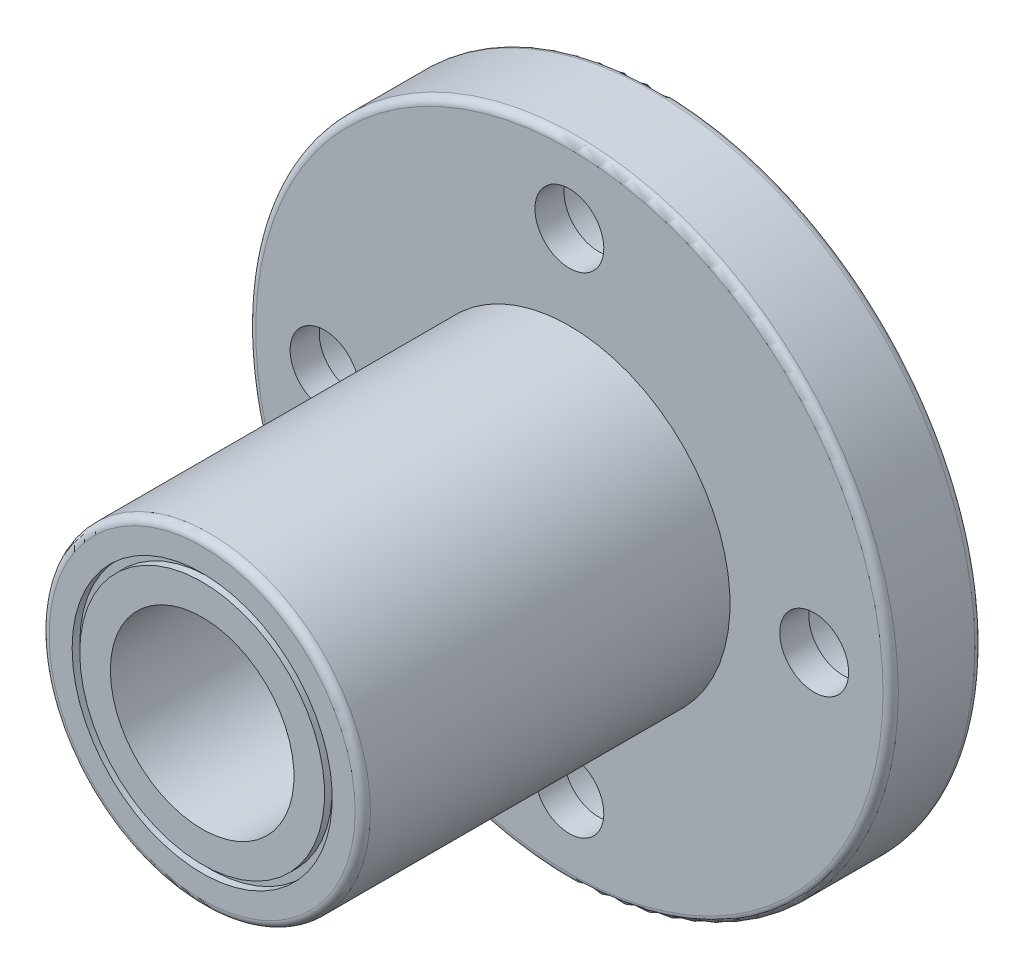
ISO-10303-21;
HEADER;
FILE_DESCRIPTION(('STEP AP214'),'2;1');
FILE_NAME('part.step','',(''),(''),'','','');
FILE_SCHEMA(('AUTOMOTIVE_DESIGN { 1 0 10303 214 1 1 1 1 }'));
ENDSEC;
DATA;
#1=APPLICATION_CONTEXT('core data for automotive mechanical design processes');
#2=APPLICATION_PROTOCOL_DEFINITION('international standard','automotive_design',2000,#1);
#3=PRODUCT_CONTEXT('',#1,'mechanical');
#4=PRODUCT('Part','Part','',(#3));
#5=PRODUCT_RELATED_PRODUCT_CATEGORY('part','',(#4));
#6=PRODUCT_DEFINITION_FORMATION('','',#4);
#7=PRODUCT_DEFINITION_CONTEXT('part definition',#1,'design');
#8=PRODUCT_DEFINITION('design','',#6,#7);
#9=PRODUCT_DEFINITION_SHAPE('','',#8);
#10=(LENGTH_UNIT() NAMED_UNIT(*) SI_UNIT(.MILLI.,.METRE.));
#11=(NAMED_UNIT(*) PLANE_ANGLE_UNIT() SI_UNIT($,.RADIAN.));
#12=(NAMED_UNIT(*) SI_UNIT($,.STERADIAN.) SOLID_ANGLE_UNIT());
#13=UNCERTAINTY_MEASURE_WITH_UNIT(LENGTH_MEASURE(1.E-05),#10,'distance_accuracy_value','');
#14=(GEOMETRIC_REPRESENTATION_CONTEXT(3) GLOBAL_UNCERTAINTY_ASSIGNED_CONTEXT((#13)) GLOBAL_UNIT_ASSIGNED_CONTEXT((#10,
#11,#12)) REPRESENTATION_CONTEXT('',''));
#15=CARTESIAN_POINT('',(0.,0.,0.));
#16=DIRECTION('',(0.,0.,1.));
#17=DIRECTION('',(1.,0.,0.));
#18=AXIS2_PLACEMENT_3D('',#15,#16,#17);
#19=CARTESIAN_POINT('',(0.,10.5,0.));
#20=DIRECTION('',(0.,0.,-1.));
#21=DIRECTION('',(-1.,0.,0.));
#22=AXIS2_PLACEMENT_3D('',#19,#20,#21);
#23=PLANE('',#22);
#24=CARTESIAN_POINT('',(0.,0.,0.));
#25=DIRECTION('',(0.,0.,-1.));
#26=DIRECTION('',(-1.,0.,0.));
#27=AXIS2_PLACEMENT_3D('',#24,#25,#26);
#28=CIRCLE('',#27,20.5);
#29=CARTESIAN_POINT('',(-20.5,0.,0.));
#30=VERTEX_POINT('',#29);
#31=EDGE_CURVE('E70',#30,#30,#28,.T.);
#32=ORIENTED_EDGE('',*,*,#31,.T.);
#33=EDGE_LOOP('',(#32));
#34=FACE_BOUND('',#33,.T.);
#35=CARTESIAN_POINT('',(0.,-16.,0.));
#36=DIRECTION('',(0.,0.,1.));
#37=DIRECTION('',(0.,1.,0.));
#38=AXIS2_PLACEMENT_3D('',#35,#36,#37);
#39=CIRCLE('',#38,3.75);
#40=CARTESIAN_POINT('',(0.,-12.25,0.));
#41=VERTEX_POINT('',#40);
#42=EDGE_CURVE('E164',#41,#41,#39,.T.);
#43=ORIENTED_EDGE('',*,*,#42,.T.);
#44=EDGE_LOOP('',(#43));
#45=FACE_BOUND('',#44,.T.);
#46=CARTESIAN_POINT('',(0.,16.,0.));
#47=DIRECTION('',(0.,0.,1.));
#48=DIRECTION('',(0.,-1.,0.));
#49=AXIS2_PLACEMENT_3D('',#46,#47,#48);
#50=CIRCLE('',#49,3.75);
#51=CARTESIAN_POINT('',(0.,12.25,0.));
#52=VERTEX_POINT('',#51);
#53=EDGE_CURVE('E132',#52,#52,#50,.T.);
#54=ORIENTED_EDGE('',*,*,#53,.T.);
#55=EDGE_LOOP('',(#54));
#56=FACE_BOUND('',#55,.T.);
#57=CARTESIAN_POINT('',(0.,0.,0.));
#58=DIRECTION('',(0.,0.,-1.));
#59=DIRECTION('',(-1.,0.,0.));
#60=AXIS2_PLACEMENT_3D('',#57,#58,#59);
#61=CIRCLE('',#60,10.5);
#62=CARTESIAN_POINT('',(-10.5,0.,0.));
#63=VERTEX_POINT('',#62);
#64=EDGE_CURVE('E128',#63,#63,#61,.T.);
#65=ORIENTED_EDGE('',*,*,#64,.F.);
#66=EDGE_LOOP('',(#65));
#67=FACE_BOUND('',#66,.T.);
#68=CARTESIAN_POINT('',(16.,0.,0.));
#69=DIRECTION('',(0.,0.,1.));
#70=DIRECTION('',(-1.,0.,0.));
#71=AXIS2_PLACEMENT_3D('',#68,#69,#70);
#72=CIRCLE('',#71,3.75);
#73=CARTESIAN_POINT('',(12.25,0.,0.));
#74=VERTEX_POINT('',#73);
#75=EDGE_CURVE('E148',#74,#74,#72,.T.);
#76=ORIENTED_EDGE('',*,*,#75,.T.);
#77=EDGE_LOOP('',(#76));
#78=FACE_BOUND('',#77,.T.);
#79=CARTESIAN_POINT('',(-16.,1.6759110426447E-13,0.));
#80=DIRECTION('',(0.,0.,1.));
#81=DIRECTION('',(1.,0.,0.));
#82=AXIS2_PLACEMENT_3D('',#79,#80,#81);
#83=CIRCLE('',#82,3.75);
#84=CARTESIAN_POINT('',(-12.25,1.28311939202485E-13,0.));
#85=VERTEX_POINT('',#84);
#86=EDGE_CURVE('E180',#85,#85,#83,.T.);
#87=ORIENTED_EDGE('',*,*,#86,.T.);
#88=EDGE_LOOP('',(#87));
#89=FACE_BOUND('',#88,.T.);
#90=ADVANCED_FACE('F40',(#34,#45,#56,#67,#78,#89),#23,.T.);
#91=CARTESIAN_POINT('',(0.,21.,6.));
#92=DIRECTION('',(0.,0.,1.));
#93=DIRECTION('',(1.,0.,0.));
#94=AXIS2_PLACEMENT_3D('',#91,#92,#93);
#95=PLANE('',#94);
#96=CARTESIAN_POINT('',(0.,0.,6.));
#97=DIRECTION('',(0.,0.,1.));
#98=DIRECTION('',(1.,0.,0.));
#99=AXIS2_PLACEMENT_3D('',#96,#97,#98);
#100=CIRCLE('',#99,20.5);
#101=CARTESIAN_POINT('',(20.5,0.,6.));
#102=VERTEX_POINT('',#101);
#103=EDGE_CURVE('E55',#102,#102,#100,.T.);
#104=ORIENTED_EDGE('',*,*,#103,.T.);
#105=EDGE_LOOP('',(#104));
#106=FACE_BOUND('',#105,.T.);
#107=CARTESIAN_POINT('',(0.,-16.,6.));
#108=DIRECTION('',(0.,0.,1.));
#109=DIRECTION('',(0.,1.,0.));
#110=AXIS2_PLACEMENT_3D('',#107,#108,#109);
#111=CIRCLE('',#110,2.24999999999999);
#112=CARTESIAN_POINT('',(0.,-13.75,6.00000000000001));
#113=VERTEX_POINT('',#112);
#114=EDGE_CURVE('E176',#113,#113,#111,.T.);
#115=ORIENTED_EDGE('',*,*,#114,.F.);
#116=EDGE_LOOP('',(#115));
#117=FACE_BOUND('',#116,.T.);
#118=CARTESIAN_POINT('',(0.,16.,6.));
#119=DIRECTION('',(0.,0.,1.));
#120=DIRECTION('',(0.,-1.,0.));
#121=AXIS2_PLACEMENT_3D('',#118,#119,#120);
#122=CIRCLE('',#121,2.24999999999999);
#123=CARTESIAN_POINT('',(0.,13.75,6.00000000000001));
#124=VERTEX_POINT('',#123);
#125=EDGE_CURVE('E144',#124,#124,#122,.T.);
#126=ORIENTED_EDGE('',*,*,#125,.F.);
#127=EDGE_LOOP('',(#126));
#128=FACE_BOUND('',#127,.T.);
#129=CARTESIAN_POINT('',(0.,0.,6.));
#130=DIRECTION('',(0.,0.,-1.));
#131=DIRECTION('',(-1.,0.,0.));
#132=AXIS2_PLACEMENT_3D('',#129,#130,#131);
#133=CIRCLE('',#132,10.5);
#134=CARTESIAN_POINT('',(-10.5,0.,6.));
#135=VERTEX_POINT('',#134);
#136=EDGE_CURVE('E73',#135,#135,#133,.T.);
#137=ORIENTED_EDGE('',*,*,#136,.T.);
#138=EDGE_LOOP('',(#137));
#139=FACE_BOUND('',#138,.T.);
#140=CARTESIAN_POINT('',(16.,0.,6.));
#141=DIRECTION('',(0.,0.,1.));
#142=DIRECTION('',(-1.,0.,0.));
#143=AXIS2_PLACEMENT_3D('',#140,#141,#142);
#144=CIRCLE('',#143,2.24999999999999);
#145=CARTESIAN_POINT('',(13.75,0.,6.00000000000001));
#146=VERTEX_POINT('',#145);
#147=EDGE_CURVE('E160',#146,#146,#144,.T.);
#148=ORIENTED_EDGE('',*,*,#147,.F.);
#149=EDGE_LOOP('',(#148));
#150=FACE_BOUND('',#149,.T.);
#151=CARTESIAN_POINT('',(-16.,1.67591104264471E-13,6.));
#152=DIRECTION('',(0.,0.,1.));
#153=DIRECTION('',(1.,0.,0.));
#154=AXIS2_PLACEMENT_3D('',#151,#152,#153);
#155=CIRCLE('',#154,2.24999999999999);
#156=CARTESIAN_POINT('',(-13.75,1.4402360522728E-13,6.00000000000001));
#157=VERTEX_POINT('',#156);
#158=EDGE_CURVE('E192',#157,#157,#155,.T.);
#159=ORIENTED_EDGE('',*,*,#158,.F.);
#160=EDGE_LOOP('',(#159));
#161=FACE_BOUND('',#160,.T.);
#162=ADVANCED_FACE('F200',(#106,#117,#128,#139,#150,#161),#95,.T.);
#163=CARTESIAN_POINT('',(0.,0.,0.));
#164=DIRECTION('',(0.,0.,-1.));
#165=DIRECTION('',(-1.,0.,0.));
#166=AXIS2_PLACEMENT_3D('',#163,#164,#165);
#167=CYLINDRICAL_SURFACE('',#166,21.);
#168=CARTESIAN_POINT('',(0.,0.,0.5));
#169=DIRECTION('',(0.,0.,-1.));
#170=DIRECTION('',(-1.,0.,0.));
#171=AXIS2_PLACEMENT_3D('',#168,#169,#170);
#172=CIRCLE('',#171,21.);
#173=CARTESIAN_POINT('',(-21.,0.,0.5));
#174=VERTEX_POINT('',#173);
#175=EDGE_CURVE('E61',#174,#174,#172,.F.);
#176=ORIENTED_EDGE('',*,*,#175,.T.);
#177=EDGE_LOOP('',(#176));
#178=FACE_BOUND('',#177,.T.);
#179=CARTESIAN_POINT('',(0.,0.,5.5));
#180=DIRECTION('',(0.,0.,1.));
#181=DIRECTION('',(1.,0.,0.));
#182=AXIS2_PLACEMENT_3D('',#179,#180,#181);
#183=CIRCLE('',#182,21.);
#184=CARTESIAN_POINT('',(21.,0.,5.5));
#185=VERTEX_POINT('',#184);
#186=EDGE_CURVE('E66',#185,#185,#183,.F.);
#187=ORIENTED_EDGE('',*,*,#186,.T.);
#188=EDGE_LOOP('',(#187));
#189=FACE_BOUND('',#188,.T.);
#190=ADVANCED_FACE('F202',(#178,#189),#167,.T.);
#191=CARTESIAN_POINT('',(0.,0.,0.));
#192=DIRECTION('',(0.,0.,-1.));
#193=DIRECTION('',(-1.,0.,0.));
#194=AXIS2_PLACEMENT_3D('',#191,#192,#193);
#195=CYLINDRICAL_SURFACE('',#194,10.5);
#196=CARTESIAN_POINT('',(0.,0.,29.5));
#197=DIRECTION('',(0.,0.,1.));
#198=DIRECTION('',(1.,0.,0.));
#199=AXIS2_PLACEMENT_3D('',#196,#197,#198);
#200=CIRCLE('',#199,10.5);
#201=CARTESIAN_POINT('',(10.5,0.,29.5));
#202=VERTEX_POINT('',#201);
#203=EDGE_CURVE('E48',#202,#202,#200,.F.);
#204=ORIENTED_EDGE('',*,*,#203,.T.);
#205=EDGE_LOOP('',(#204));
#206=FACE_BOUND('',#205,.T.);
#207=ORIENTED_EDGE('',*,*,#136,.F.);
#208=EDGE_LOOP('',(#207));
#209=FACE_BOUND('',#208,.T.);
#210=ADVANCED_FACE('F209',(#206,#209),#195,.T.);
#211=CARTESIAN_POINT('',(0.,10.5,30.));
#212=DIRECTION('',(0.,0.,1.));
#213=DIRECTION('',(1.,0.,0.));
#214=AXIS2_PLACEMENT_3D('',#211,#212,#213);
#215=PLANE('',#214);
#216=CARTESIAN_POINT('',(0.,0.,30.));
#217=DIRECTION('',(0.,0.,1.));
#218=DIRECTION('',(1.,0.,0.));
#219=AXIS2_PLACEMENT_3D('',#216,#217,#218);
#220=CIRCLE('',#219,10.);
#221=CARTESIAN_POINT('',(10.,0.,30.));
#222=VERTEX_POINT('',#221);
#223=EDGE_CURVE('E10',#222,#222,#220,.T.);
#224=ORIENTED_EDGE('',*,*,#223,.T.);
#225=EDGE_LOOP('',(#224));
#226=FACE_BOUND('',#225,.T.);
#227=CARTESIAN_POINT('',(0.,0.,30.));
#228=DIRECTION('',(0.,0.,-1.));
#229=DIRECTION('',(-1.,0.,0.));
#230=AXIS2_PLACEMENT_3D('',#227,#228,#229);
#231=CIRCLE('',#230,8.5);
#232=CARTESIAN_POINT('',(-8.5,0.,30.));
#233=VERTEX_POINT('',#232);
#234=EDGE_CURVE('E77',#233,#233,#231,.T.);
#235=ORIENTED_EDGE('',*,*,#234,.T.);
#236=EDGE_LOOP('',(#235));
#237=FACE_BOUND('',#236,.T.);
#238=ADVANCED_FACE('F466',(#226,#237),#215,.T.);
#239=CARTESIAN_POINT('',(0.,0.,0.));
#240=DIRECTION('',(0.,0.,-1.));
#241=DIRECTION('',(-1.,0.,0.));
#242=AXIS2_PLACEMENT_3D('',#239,#240,#241);
#243=CYLINDRICAL_SURFACE('',#242,8.5);
#244=CARTESIAN_POINT('',(0.,0.,29.5));
#245=DIRECTION('',(0.,0.,-1.));
#246=DIRECTION('',(-1.,0.,0.));
#247=AXIS2_PLACEMENT_3D('',#244,#245,#246);
#248=CIRCLE('',#247,8.5);
#249=CARTESIAN_POINT('',(-8.5,0.,29.5));
#250=VERTEX_POINT('',#249);
#251=EDGE_CURVE('E81',#250,#250,#248,.T.);
#252=ORIENTED_EDGE('',*,*,#251,.T.);
#253=EDGE_LOOP('',(#252));
#254=FACE_BOUND('',#253,.T.);
#255=ORIENTED_EDGE('',*,*,#234,.F.);
#256=EDGE_LOOP('',(#255));
#257=FACE_BOUND('',#256,.T.);
#258=ADVANCED_FACE('F457',(#254,#257),#243,.F.);
#259=CARTESIAN_POINT('',(0.,8.5,29.5));
#260=DIRECTION('',(0.,0.,1.));
#261=DIRECTION('',(1.,0.,0.));
#262=AXIS2_PLACEMENT_3D('',#259,#260,#261);
#263=PLANE('',#262);
#264=CARTESIAN_POINT('',(0.,0.,29.5));
#265=DIRECTION('',(0.,0.,-1.));
#266=DIRECTION('',(-1.,0.,0.));
#267=AXIS2_PLACEMENT_3D('',#264,#265,#266);
#268=CIRCLE('',#267,8.);
#269=CARTESIAN_POINT('',(-8.,0.,29.5));
#270=VERTEX_POINT('',#269);
#271=EDGE_CURVE('E85',#270,#270,#268,.T.);
#272=ORIENTED_EDGE('',*,*,#271,.T.);
#273=EDGE_LOOP('',(#272));
#274=FACE_BOUND('',#273,.T.);
#275=ORIENTED_EDGE('',*,*,#251,.F.);
#276=EDGE_LOOP('',(#275));
#277=FACE_BOUND('',#276,.T.);
#278=ADVANCED_FACE('F448',(#274,#277),#263,.T.);
#279=CARTESIAN_POINT('',(0.,0.,0.));
#280=DIRECTION('',(0.,0.,-1.));
#281=DIRECTION('',(-1.,0.,0.));
#282=AXIS2_PLACEMENT_3D('',#279,#280,#281);
#283=CYLINDRICAL_SURFACE('',#282,8.);
#284=CARTESIAN_POINT('',(0.,0.,30.));
#285=DIRECTION('',(0.,0.,-1.));
#286=DIRECTION('',(-1.,0.,0.));
#287=AXIS2_PLACEMENT_3D('',#284,#285,#286);
#288=CIRCLE('',#287,8.);
#289=CARTESIAN_POINT('',(-8.,0.,30.));
#290=VERTEX_POINT('',#289);
#291=EDGE_CURVE('E89',#290,#290,#288,.T.);
#292=ORIENTED_EDGE('',*,*,#291,.T.);
#293=EDGE_LOOP('',(#292));
#294=FACE_BOUND('',#293,.T.);
#295=ORIENTED_EDGE('',*,*,#271,.F.);
#296=EDGE_LOOP('',(#295));
#297=FACE_BOUND('',#296,.T.);
#298=ADVANCED_FACE('F440',(#294,#297),#283,.T.);
#299=CARTESIAN_POINT('',(0.,8.,30.));
#300=DIRECTION('',(0.,0.,1.));
#301=DIRECTION('',(1.,0.,0.));
#302=AXIS2_PLACEMENT_3D('',#299,#300,#301);
#303=PLANE('',#302);
#304=CARTESIAN_POINT('',(0.,0.,30.));
#305=DIRECTION('',(0.,0.,-1.));
#306=DIRECTION('',(-1.,0.,0.));
#307=AXIS2_PLACEMENT_3D('',#304,#305,#306);
#308=CIRCLE('',#307,6.);
#309=CARTESIAN_POINT('',(-6.,0.,30.));
#310=VERTEX_POINT('',#309);
#311=EDGE_CURVE('E92',#310,#310,#308,.T.);
#312=ORIENTED_EDGE('',*,*,#311,.T.);
#313=EDGE_LOOP('',(#312));
#314=FACE_BOUND('',#313,.T.);
#315=ORIENTED_EDGE('',*,*,#291,.F.);
#316=EDGE_LOOP('',(#315));
#317=FACE_BOUND('',#316,.T.);
#318=ADVANCED_FACE('F432',(#314,#317),#303,.T.);
#319=CARTESIAN_POINT('',(0.,0.,0.));
#320=DIRECTION('',(0.,0.,-1.));
#321=DIRECTION('',(-1.,0.,0.));
#322=AXIS2_PLACEMENT_3D('',#319,#320,#321);
#323=CYLINDRICAL_SURFACE('',#322,6.);
#324=CARTESIAN_POINT('',(0.,0.,0.));
#325=DIRECTION('',(0.,0.,-1.));
#326=DIRECTION('',(-1.,0.,0.));
#327=AXIS2_PLACEMENT_3D('',#324,#325,#326);
#328=CIRCLE('',#327,6.);
#329=CARTESIAN_POINT('',(-6.,0.,0.));
#330=VERTEX_POINT('',#329);
#331=EDGE_CURVE('E96',#330,#330,#328,.T.);
#332=ORIENTED_EDGE('',*,*,#331,.T.);
#333=EDGE_LOOP('',(#332));
#334=FACE_BOUND('',#333,.T.);
#335=ORIENTED_EDGE('',*,*,#311,.F.);
#336=EDGE_LOOP('',(#335));
#337=FACE_BOUND('',#336,.T.);
#338=ADVANCED_FACE('F423',(#334,#337),#323,.F.);
#339=CARTESIAN_POINT('',(0.,6.,0.));
#340=DIRECTION('',(0.,0.,-1.));
#341=DIRECTION('',(-1.,0.,0.));
#342=AXIS2_PLACEMENT_3D('',#339,#340,#341);
#343=PLANE('',#342);
#344=CARTESIAN_POINT('',(0.,0.,0.));
#345=DIRECTION('',(0.,0.,-1.));
#346=DIRECTION('',(-1.,0.,0.));
#347=AXIS2_PLACEMENT_3D('',#344,#345,#346);
#348=CIRCLE('',#347,8.);
#349=CARTESIAN_POINT('',(-8.,0.,0.));
#350=VERTEX_POINT('',#349);
#351=EDGE_CURVE('E100',#350,#350,#348,.T.);
#352=ORIENTED_EDGE('',*,*,#351,.T.);
#353=EDGE_LOOP('',(#352));
#354=FACE_BOUND('',#353,.T.);
#355=ORIENTED_EDGE('',*,*,#331,.F.);
#356=EDGE_LOOP('',(#355));
#357=FACE_BOUND('',#356,.T.);
#358=ADVANCED_FACE('F414',(#354,#357),#343,.T.);
#359=CARTESIAN_POINT('',(0.,0.,0.));
#360=DIRECTION('',(0.,0.,-1.));
#361=DIRECTION('',(-1.,0.,0.));
#362=AXIS2_PLACEMENT_3D('',#359,#360,#361);
#363=CYLINDRICAL_SURFACE('',#362,8.);
#364=CARTESIAN_POINT('',(0.,0.,0.5));
#365=DIRECTION('',(0.,0.,-1.));
#366=DIRECTION('',(-1.,0.,0.));
#367=AXIS2_PLACEMENT_3D('',#364,#365,#366);
#368=CIRCLE('',#367,8.);
#369=CARTESIAN_POINT('',(-8.,0.,0.5));
#370=VERTEX_POINT('',#369);
#371=EDGE_CURVE('E104',#370,#370,#368,.T.);
#372=ORIENTED_EDGE('',*,*,#371,.T.);
#373=EDGE_LOOP('',(#372));
#374=FACE_BOUND('',#373,.T.);
#375=ORIENTED_EDGE('',*,*,#351,.F.);
#376=EDGE_LOOP('',(#375));
#377=FACE_BOUND('',#376,.T.);
#378=ADVANCED_FACE('F405',(#374,#377),#363,.T.);
#379=CARTESIAN_POINT('',(0.,8.5,0.5));
#380=DIRECTION('',(0.,0.,-1.));
#381=DIRECTION('',(-1.,0.,0.));
#382=AXIS2_PLACEMENT_3D('',#379,#380,#381);
#383=PLANE('',#382);
#384=CARTESIAN_POINT('',(0.,0.,0.5));
#385=DIRECTION('',(0.,0.,-1.));
#386=DIRECTION('',(-1.,0.,0.));
#387=AXIS2_PLACEMENT_3D('',#384,#385,#386);
#388=CIRCLE('',#387,8.5);
#389=CARTESIAN_POINT('',(-8.5,0.,0.5));
#390=VERTEX_POINT('',#389);
#391=EDGE_CURVE('E108',#390,#390,#388,.T.);
#392=ORIENTED_EDGE('',*,*,#391,.T.);
#393=EDGE_LOOP('',(#392));
#394=FACE_BOUND('',#393,.T.);
#395=ORIENTED_EDGE('',*,*,#371,.F.);
#396=EDGE_LOOP('',(#395));
#397=FACE_BOUND('',#396,.T.);
#398=ADVANCED_FACE('F396',(#394,#397),#383,.T.);
#399=CARTESIAN_POINT('',(0.,0.,0.));
#400=DIRECTION('',(0.,0.,-1.));
#401=DIRECTION('',(-1.,0.,0.));
#402=AXIS2_PLACEMENT_3D('',#399,#400,#401);
#403=CYLINDRICAL_SURFACE('',#402,8.5);
#404=CARTESIAN_POINT('',(0.,0.,0.));
#405=DIRECTION('',(0.,0.,-1.));
#406=DIRECTION('',(-1.,0.,0.));
#407=AXIS2_PLACEMENT_3D('',#404,#405,#406);
#408=CIRCLE('',#407,8.5);
#409=CARTESIAN_POINT('',(-8.5,0.,0.));
#410=VERTEX_POINT('',#409);
#411=EDGE_CURVE('E112',#410,#410,#408,.T.);
#412=ORIENTED_EDGE('',*,*,#411,.T.);
#413=EDGE_LOOP('',(#412));
#414=FACE_BOUND('',#413,.T.);
#415=ORIENTED_EDGE('',*,*,#391,.F.);
#416=EDGE_LOOP('',(#415));
#417=FACE_BOUND('',#416,.T.);
#418=ADVANCED_FACE('F387',(#414,#417),#403,.F.);
#419=CARTESIAN_POINT('',(0.,8.5,0.));
#420=DIRECTION('',(0.,0.,-1.));
#421=DIRECTION('',(-1.,0.,0.));
#422=AXIS2_PLACEMENT_3D('',#419,#420,#421);
#423=PLANE('',#422);
#424=CARTESIAN_POINT('',(0.,0.,0.));
#425=DIRECTION('',(0.,0.,-1.));
#426=DIRECTION('',(-1.,0.,0.));
#427=AXIS2_PLACEMENT_3D('',#424,#425,#426);
#428=CIRCLE('',#427,10.);
#429=CARTESIAN_POINT('',(-10.,0.,0.));
#430=VERTEX_POINT('',#429);
#431=EDGE_CURVE('E116',#430,#430,#428,.T.);
#432=ORIENTED_EDGE('',*,*,#431,.T.);
#433=EDGE_LOOP('',(#432));
#434=FACE_BOUND('',#433,.T.);
#435=ORIENTED_EDGE('',*,*,#411,.F.);
#436=EDGE_LOOP('',(#435));
#437=FACE_BOUND('',#436,.T.);
#438=ADVANCED_FACE('F378',(#434,#437),#423,.T.);
#439=CARTESIAN_POINT('',(0.,0.,0.));
#440=DIRECTION('',(0.,0.,-1.));
#441=DIRECTION('',(-1.,0.,0.));
#442=AXIS2_PLACEMENT_3D('',#439,#440,#441);
#443=CYLINDRICAL_SURFACE('',#442,10.);
#444=CARTESIAN_POINT('',(0.,0.,0.499999999999999));
#445=DIRECTION('',(0.,0.,-1.));
#446=DIRECTION('',(-1.,0.,0.));
#447=AXIS2_PLACEMENT_3D('',#444,#445,#446);
#448=CIRCLE('',#447,10.);
#449=CARTESIAN_POINT('',(-10.,0.,0.499999999999999));
#450=VERTEX_POINT('',#449);
#451=EDGE_CURVE('E120',#450,#450,#448,.T.);
#452=ORIENTED_EDGE('',*,*,#451,.T.);
#453=EDGE_LOOP('',(#452));
#454=FACE_BOUND('',#453,.T.);
#455=ORIENTED_EDGE('',*,*,#431,.F.);
#456=EDGE_LOOP('',(#455));
#457=FACE_BOUND('',#456,.T.);
#458=ADVANCED_FACE('F369',(#454,#457),#443,.T.);
#459=CARTESIAN_POINT('',(0.,10.5,0.5));
#460=DIRECTION('',(0.,0.,-1.));
#461=DIRECTION('',(-1.,0.,0.));
#462=AXIS2_PLACEMENT_3D('',#459,#460,#461);
#463=PLANE('',#462);
#464=CARTESIAN_POINT('',(0.,0.,0.5));
#465=DIRECTION('',(0.,0.,-1.));
#466=DIRECTION('',(-1.,0.,0.));
#467=AXIS2_PLACEMENT_3D('',#464,#465,#466);
#468=CIRCLE('',#467,10.5);
#469=CARTESIAN_POINT('',(-10.5,0.,0.5));
#470=VERTEX_POINT('',#469);
#471=EDGE_CURVE('E124',#470,#470,#468,.T.);
#472=ORIENTED_EDGE('',*,*,#471,.T.);
#473=EDGE_LOOP('',(#472));
#474=FACE_BOUND('',#473,.T.);
#475=ORIENTED_EDGE('',*,*,#451,.F.);
#476=EDGE_LOOP('',(#475));
#477=FACE_BOUND('',#476,.T.);
#478=ADVANCED_FACE('F360',(#474,#477),#463,.T.);
#479=CARTESIAN_POINT('',(0.,0.,0.));
#480=DIRECTION('',(0.,0.,-1.));
#481=DIRECTION('',(-1.,0.,0.));
#482=AXIS2_PLACEMENT_3D('',#479,#480,#481);
#483=CYLINDRICAL_SURFACE('',#482,10.5);
#484=ORIENTED_EDGE('',*,*,#64,.T.);
#485=EDGE_LOOP('',(#484));
#486=FACE_BOUND('',#485,.T.);
#487=ORIENTED_EDGE('',*,*,#471,.F.);
#488=EDGE_LOOP('',(#487));
#489=FACE_BOUND('',#488,.T.);
#490=ADVANCED_FACE('F351',(#486,#489),#483,.F.);
#491=CARTESIAN_POINT('',(0.,16.,0.));
#492=DIRECTION('',(0.,0.,1.));
#493=DIRECTION('',(0.,-1.,0.));
#494=AXIS2_PLACEMENT_3D('',#491,#492,#493);
#495=CYLINDRICAL_SURFACE('',#494,3.74999999999999);
#496=CARTESIAN_POINT('',(0.,16.,4.10000000000001));
#497=DIRECTION('',(0.,0.,1.));
#498=DIRECTION('',(0.,-1.,0.));
#499=AXIS2_PLACEMENT_3D('',#496,#497,#498);
#500=CIRCLE('',#499,3.74999999999999);
#501=CARTESIAN_POINT('',(0.,12.25,4.10000000000001));
#502=VERTEX_POINT('',#501);
#503=EDGE_CURVE('E136',#502,#502,#500,.T.);
#504=ORIENTED_EDGE('',*,*,#503,.T.);
#505=EDGE_LOOP('',(#504));
#506=FACE_BOUND('',#505,.T.);
#507=ORIENTED_EDGE('',*,*,#53,.F.);
#508=EDGE_LOOP('',(#507));
#509=FACE_BOUND('',#508,.T.);
#510=ADVANCED_FACE('F342',(#506,#509),#495,.F.);
#511=CARTESIAN_POINT('',(0.,19.75,4.1));
#512=DIRECTION('',(0.,0.,-1.));
#513=DIRECTION('',(0.,1.,0.));
#514=AXIS2_PLACEMENT_3D('',#511,#512,#513);
#515=PLANE('',#514);
#516=CARTESIAN_POINT('',(0.,16.,4.1));
#517=DIRECTION('',(0.,0.,1.));
#518=DIRECTION('',(0.,-1.,0.));
#519=AXIS2_PLACEMENT_3D('',#516,#517,#518);
#520=CIRCLE('',#519,2.24999999999999);
#521=CARTESIAN_POINT('',(0.,13.75,4.10000000000001));
#522=VERTEX_POINT('',#521);
#523=EDGE_CURVE('E140',#522,#522,#520,.T.);
#524=ORIENTED_EDGE('',*,*,#523,.T.);
#525=EDGE_LOOP('',(#524));
#526=FACE_BOUND('',#525,.T.);
#527=ORIENTED_EDGE('',*,*,#503,.F.);
#528=EDGE_LOOP('',(#527));
#529=FACE_BOUND('',#528,.T.);
#530=ADVANCED_FACE('F333',(#526,#529),#515,.T.);
#531=CARTESIAN_POINT('',(0.,16.,0.));
#532=DIRECTION('',(0.,0.,1.));
#533=DIRECTION('',(0.,-1.,0.));
#534=AXIS2_PLACEMENT_3D('',#531,#532,#533);
#535=CYLINDRICAL_SURFACE('',#534,2.24999999999999);
#536=ORIENTED_EDGE('',*,*,#125,.T.);
#537=EDGE_LOOP('',(#536));
#538=FACE_BOUND('',#537,.T.);
#539=ORIENTED_EDGE('',*,*,#523,.F.);
#540=EDGE_LOOP('',(#539));
#541=FACE_BOUND('',#540,.T.);
#542=ADVANCED_FACE('F324',(#538,#541),#535,.F.);
#543=CARTESIAN_POINT('',(16.,0.,0.));
#544=DIRECTION('',(0.,0.,1.));
#545=DIRECTION('',(-1.,0.,0.));
#546=AXIS2_PLACEMENT_3D('',#543,#544,#545);
#547=CYLINDRICAL_SURFACE('',#546,3.74999999999999);
#548=CARTESIAN_POINT('',(16.,0.,4.10000000000001));
#549=DIRECTION('',(0.,0.,1.));
#550=DIRECTION('',(-1.,0.,0.));
#551=AXIS2_PLACEMENT_3D('',#548,#549,#550);
#552=CIRCLE('',#551,3.74999999999999);
#553=CARTESIAN_POINT('',(12.25,0.,4.10000000000001));
#554=VERTEX_POINT('',#553);
#555=EDGE_CURVE('E152',#554,#554,#552,.T.);
#556=ORIENTED_EDGE('',*,*,#555,.T.);
#557=EDGE_LOOP('',(#556));
#558=FACE_BOUND('',#557,.T.);
#559=ORIENTED_EDGE('',*,*,#75,.F.);
#560=EDGE_LOOP('',(#559));
#561=FACE_BOUND('',#560,.T.);
#562=ADVANCED_FACE('F316',(#558,#561),#547,.F.);
#563=CARTESIAN_POINT('',(19.75,0.,4.1));
#564=DIRECTION('',(0.,0.,-1.));
#565=DIRECTION('',(1.,0.,0.));
#566=AXIS2_PLACEMENT_3D('',#563,#564,#565);
#567=PLANE('',#566);
#568=CARTESIAN_POINT('',(16.,0.,4.1));
#569=DIRECTION('',(0.,0.,1.));
#570=DIRECTION('',(-1.,0.,0.));
#571=AXIS2_PLACEMENT_3D('',#568,#569,#570);
#572=CIRCLE('',#571,2.24999999999999);
#573=CARTESIAN_POINT('',(13.75,0.,4.10000000000001));
#574=VERTEX_POINT('',#573);
#575=EDGE_CURVE('E156',#574,#574,#572,.T.);
#576=ORIENTED_EDGE('',*,*,#575,.T.);
#577=EDGE_LOOP('',(#576));
#578=FACE_BOUND('',#577,.T.);
#579=ORIENTED_EDGE('',*,*,#555,.F.);
#580=EDGE_LOOP('',(#579));
#581=FACE_BOUND('',#580,.T.);
#582=ADVANCED_FACE('F308',(#578,#581),#567,.T.);
#583=CARTESIAN_POINT('',(16.,0.,0.));
#584=DIRECTION('',(0.,0.,1.));
#585=DIRECTION('',(-1.,0.,0.));
#586=AXIS2_PLACEMENT_3D('',#583,#584,#585);
#587=CYLINDRICAL_SURFACE('',#586,2.24999999999999);
#588=ORIENTED_EDGE('',*,*,#147,.T.);
#589=EDGE_LOOP('',(#588));
#590=FACE_BOUND('',#589,.T.);
#591=ORIENTED_EDGE('',*,*,#575,.F.);
#592=EDGE_LOOP('',(#591));
#593=FACE_BOUND('',#592,.T.);
#594=ADVANCED_FACE('F300',(#590,#593),#587,.F.);
#595=CARTESIAN_POINT('',(0.,-16.,0.));
#596=DIRECTION('',(0.,0.,1.));
#597=DIRECTION('',(0.,1.,0.));
#598=AXIS2_PLACEMENT_3D('',#595,#596,#597);
#599=CYLINDRICAL_SURFACE('',#598,3.74999999999999);
#600=CARTESIAN_POINT('',(0.,-16.,4.10000000000001));
#601=DIRECTION('',(0.,0.,1.));
#602=DIRECTION('',(0.,1.,0.));
#603=AXIS2_PLACEMENT_3D('',#600,#601,#602);
#604=CIRCLE('',#603,3.74999999999999);
#605=CARTESIAN_POINT('',(0.,-12.25,4.10000000000001));
#606=VERTEX_POINT('',#605);
#607=EDGE_CURVE('E168',#606,#606,#604,.T.);
#608=ORIENTED_EDGE('',*,*,#607,.T.);
#609=EDGE_LOOP('',(#608));
#610=FACE_BOUND('',#609,.T.);
#611=ORIENTED_EDGE('',*,*,#42,.F.);
#612=EDGE_LOOP('',(#611));
#613=FACE_BOUND('',#612,.T.);
#614=ADVANCED_FACE('F292',(#610,#613),#599,.F.);
#615=CARTESIAN_POINT('',(0.,-19.75,4.1));
#616=DIRECTION('',(0.,0.,-1.));
#617=DIRECTION('',(0.,-1.,0.));
#618=AXIS2_PLACEMENT_3D('',#615,#616,#617);
#619=PLANE('',#618);
#620=CARTESIAN_POINT('',(0.,-16.,4.1));
#621=DIRECTION('',(0.,0.,1.));
#622=DIRECTION('',(0.,1.,0.));
#623=AXIS2_PLACEMENT_3D('',#620,#621,#622);
#624=CIRCLE('',#623,2.24999999999999);
#625=CARTESIAN_POINT('',(0.,-13.75,4.10000000000001));
#626=VERTEX_POINT('',#625);
#627=EDGE_CURVE('E172',#626,#626,#624,.T.);
#628=ORIENTED_EDGE('',*,*,#627,.T.);
#629=EDGE_LOOP('',(#628));
#630=FACE_BOUND('',#629,.T.);
#631=ORIENTED_EDGE('',*,*,#607,.F.);
#632=EDGE_LOOP('',(#631));
#633=FACE_BOUND('',#632,.T.);
#634=ADVANCED_FACE('F283',(#630,#633),#619,.T.);
#635=CARTESIAN_POINT('',(0.,-16.,0.));
#636=DIRECTION('',(0.,0.,1.));
#637=DIRECTION('',(0.,1.,0.));
#638=AXIS2_PLACEMENT_3D('',#635,#636,#637);
#639=CYLINDRICAL_SURFACE('',#638,2.24999999999999);
#640=ORIENTED_EDGE('',*,*,#114,.T.);
#641=EDGE_LOOP('',(#640));
#642=FACE_BOUND('',#641,.T.);
#643=ORIENTED_EDGE('',*,*,#627,.F.);
#644=EDGE_LOOP('',(#643));
#645=FACE_BOUND('',#644,.T.);
#646=ADVANCED_FACE('F272',(#642,#645),#639,.F.);
#647=CARTESIAN_POINT('',(-16.,1.6759110426447E-13,0.));
#648=DIRECTION('',(0.,0.,1.));
#649=DIRECTION('',(1.,0.,0.));
#650=AXIS2_PLACEMENT_3D('',#647,#648,#649);
#651=CYLINDRICAL_SURFACE('',#650,3.74999999999999);
#652=CARTESIAN_POINT('',(-16.,1.67591104264471E-13,4.10000000000001));
#653=DIRECTION('',(0.,0.,1.));
#654=DIRECTION('',(1.,0.,0.));
#655=AXIS2_PLACEMENT_3D('',#652,#653,#654);
#656=CIRCLE('',#655,3.74999999999999);
#657=CARTESIAN_POINT('',(-12.25,1.28311939202485E-13,4.10000000000001));
#658=VERTEX_POINT('',#657);
#659=EDGE_CURVE('E184',#658,#658,#656,.T.);
#660=ORIENTED_EDGE('',*,*,#659,.T.);
#661=EDGE_LOOP('',(#660));
#662=FACE_BOUND('',#661,.T.);
#663=ORIENTED_EDGE('',*,*,#86,.F.);
#664=EDGE_LOOP('',(#663));
#665=FACE_BOUND('',#664,.T.);
#666=ADVANCED_FACE('F261',(#662,#665),#651,.F.);
#667=CARTESIAN_POINT('',(-19.75,2.06870269326456E-13,4.1));
#668=DIRECTION('',(0.,0.,-1.));
#669=DIRECTION('',(-1.,0.,0.));
#670=AXIS2_PLACEMENT_3D('',#667,#668,#669);
#671=PLANE('',#670);
#672=CARTESIAN_POINT('',(-16.,1.67591104264471E-13,4.1));
#673=DIRECTION('',(0.,0.,1.));
#674=DIRECTION('',(1.,0.,0.));
#675=AXIS2_PLACEMENT_3D('',#672,#673,#674);
#676=CIRCLE('',#675,2.24999999999999);
#677=CARTESIAN_POINT('',(-13.75,1.44023605227279E-13,4.10000000000001));
#678=VERTEX_POINT('',#677);
#679=EDGE_CURVE('E188',#678,#678,#676,.T.);
#680=ORIENTED_EDGE('',*,*,#679,.T.);
#681=EDGE_LOOP('',(#680));
#682=FACE_BOUND('',#681,.T.);
#683=ORIENTED_EDGE('',*,*,#659,.F.);
#684=EDGE_LOOP('',(#683));
#685=FACE_BOUND('',#684,.T.);
#686=ADVANCED_FACE('F251',(#682,#685),#671,.T.);
#687=CARTESIAN_POINT('',(-16.,1.6759110426447E-13,0.));
#688=DIRECTION('',(0.,0.,1.));
#689=DIRECTION('',(1.,0.,0.));
#690=AXIS2_PLACEMENT_3D('',#687,#688,#689);
#691=CYLINDRICAL_SURFACE('',#690,2.24999999999999);
#692=ORIENTED_EDGE('',*,*,#158,.T.);
#693=EDGE_LOOP('',(#692));
#694=FACE_BOUND('',#693,.T.);
#695=ORIENTED_EDGE('',*,*,#679,.F.);
#696=EDGE_LOOP('',(#695));
#697=FACE_BOUND('',#696,.T.);
#698=ADVANCED_FACE('F197',(#694,#697),#691,.F.);
#699=CARTESIAN_POINT('',(0.,0.,0.5));
#700=DIRECTION('',(0.,0.,-1.));
#701=DIRECTION('',(-1.,0.,0.));
#702=AXIS2_PLACEMENT_3D('',#699,#700,#701);
#703=TOROIDAL_SURFACE('',#702,20.5,0.5);
#704=ORIENTED_EDGE('',*,*,#175,.F.);
#705=EDGE_LOOP('',(#704));
#706=FACE_BOUND('',#705,.T.);
#707=ORIENTED_EDGE('',*,*,#31,.F.);
#708=EDGE_LOOP('',(#707));
#709=FACE_BOUND('',#708,.T.);
#710=ADVANCED_FACE('F218',(#706,#709),#703,.T.);
#711=CARTESIAN_POINT('',(0.,0.,5.5));
#712=DIRECTION('',(0.,0.,1.));
#713=DIRECTION('',(1.,0.,0.));
#714=AXIS2_PLACEMENT_3D('',#711,#712,#713);
#715=TOROIDAL_SURFACE('',#714,20.5,0.5);
#716=ORIENTED_EDGE('',*,*,#103,.F.);
#717=EDGE_LOOP('',(#716));
#718=FACE_BOUND('',#717,.T.);
#719=ORIENTED_EDGE('',*,*,#186,.F.);
#720=EDGE_LOOP('',(#719));
#721=FACE_BOUND('',#720,.T.);
#722=ADVANCED_FACE('F220',(#718,#721),#715,.T.);
#723=CARTESIAN_POINT('',(0.,0.,29.5));
#724=DIRECTION('',(0.,0.,1.));
#725=DIRECTION('',(1.,0.,0.));
#726=AXIS2_PLACEMENT_3D('',#723,#724,#725);
#727=TOROIDAL_SURFACE('',#726,10.,0.5);
#728=ORIENTED_EDGE('',*,*,#223,.F.);
#729=EDGE_LOOP('',(#728));
#730=FACE_BOUND('',#729,.T.);
#731=ORIENTED_EDGE('',*,*,#203,.F.);
#732=EDGE_LOOP('',(#731));
#733=FACE_BOUND('',#732,.T.);
#734=ADVANCED_FACE('F42',(#730,#733),#727,.T.);
#735=CLOSED_SHELL('',(#90,#162,#190,#210,#238,#258,#278,#298,#318,#338,#358,#378,#398,#418,#438,
#458,#478,#490,#510,#530,#542,#562,#582,#594,#614,#634,#646,#666,#686,#698,#710,#722,#734));
#736=MANIFOLD_SOLID_BREP('B2',#735);
#737=ADVANCED_BREP_SHAPE_REPRESENTATION('',(#18,#736),#14);
#738=SHAPE_DEFINITION_REPRESENTATION(#9,#737);
ENDSEC;
END-ISO-10303-21;
